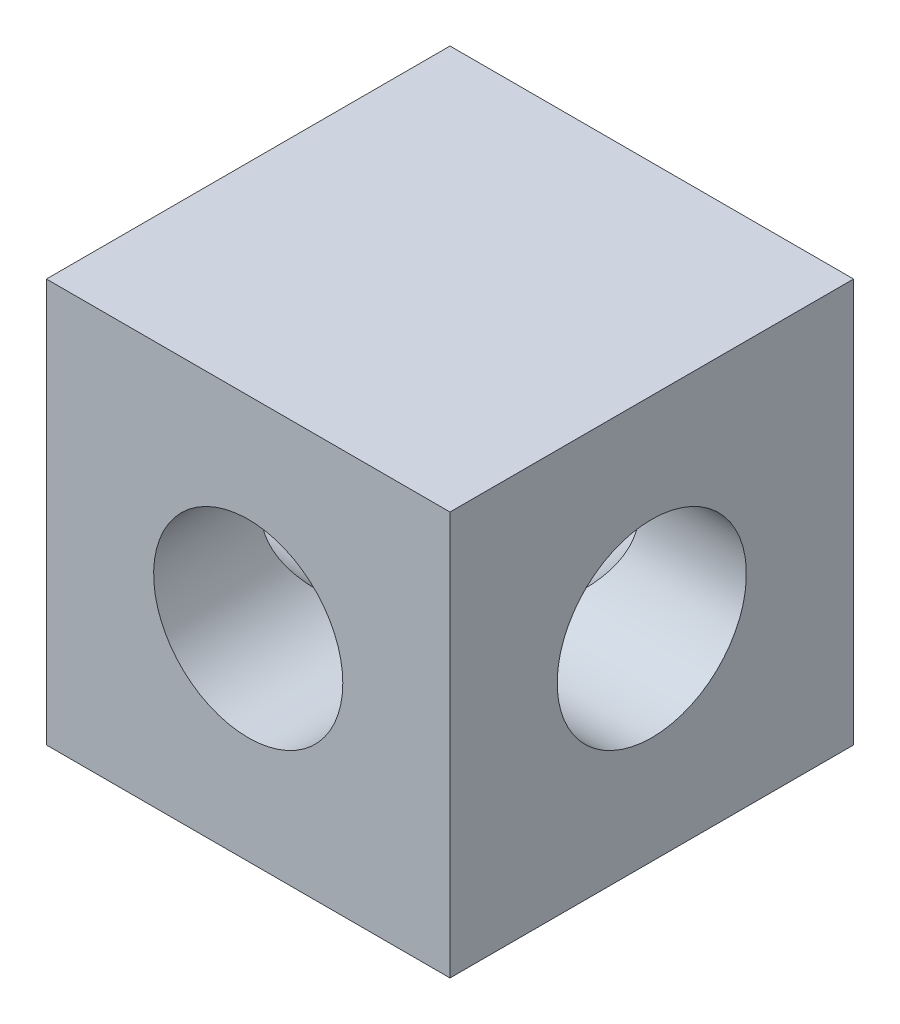
ISO-10303-21;
HEADER;
FILE_DESCRIPTION(('STEP AP214'),'2;1');
FILE_NAME('part.step','',(''),(''),'','','');
FILE_SCHEMA(('AUTOMOTIVE_DESIGN { 1 0 10303 214 1 1 1 1 }'));
ENDSEC;
DATA;
#1=APPLICATION_CONTEXT('core data for automotive mechanical design processes');
#2=APPLICATION_PROTOCOL_DEFINITION('international standard','automotive_design',2000,#1);
#3=PRODUCT_CONTEXT('',#1,'mechanical');
#4=PRODUCT('Part','Part','',(#3));
#5=PRODUCT_RELATED_PRODUCT_CATEGORY('part','',(#4));
#6=PRODUCT_DEFINITION_FORMATION('','',#4);
#7=PRODUCT_DEFINITION_CONTEXT('part definition',#1,'design');
#8=PRODUCT_DEFINITION('design','',#6,#7);
#9=PRODUCT_DEFINITION_SHAPE('','',#8);
#10=(LENGTH_UNIT() NAMED_UNIT(*) SI_UNIT(.MILLI.,.METRE.));
#11=(NAMED_UNIT(*) PLANE_ANGLE_UNIT() SI_UNIT($,.RADIAN.));
#12=(NAMED_UNIT(*) SI_UNIT($,.STERADIAN.) SOLID_ANGLE_UNIT());
#13=UNCERTAINTY_MEASURE_WITH_UNIT(LENGTH_MEASURE(1.E-05),#10,'distance_accuracy_value','');
#14=(GEOMETRIC_REPRESENTATION_CONTEXT(3) GLOBAL_UNCERTAINTY_ASSIGNED_CONTEXT((#13)) GLOBAL_UNIT_ASSIGNED_CONTEXT((#10,
#11,#12)) REPRESENTATION_CONTEXT('',''));
#15=CARTESIAN_POINT('',(0.,0.,0.));
#16=DIRECTION('',(0.,0.,1.));
#17=DIRECTION('',(1.,0.,0.));
#18=AXIS2_PLACEMENT_3D('',#15,#16,#17);
#19=CARTESIAN_POINT('',(-16.9782681564246,8.53525139664804,20.32));
#20=DIRECTION('',(0.,0.,-1.));
#21=DIRECTION('',(-1.,0.,0.));
#22=AXIS2_PLACEMENT_3D('',#19,#20,#21);
#23=CYLINDRICAL_SURFACE('',#22,4.7625);
#24=CARTESIAN_POINT('',(-16.9782681564246,8.53525139664804,10.16));
#25=DIRECTION('',(0.707106781186547,0.,-0.707106781186547));
#26=DIRECTION('',(-0.707106781186547,0.,-0.707106781186547));
#27=AXIS2_PLACEMENT_3D('',#24,#25,#26);
#28=ELLIPSE('',#27,6.73519209080187,4.7625);
#29=CARTESIAN_POINT('',(-16.9782681564246,3.77275139664804,10.16));
#30=VERTEX_POINT('',#29);
#31=CARTESIAN_POINT('',(-16.9782681564246,13.297751396648,10.16));
#32=VERTEX_POINT('',#31);
#33=EDGE_CURVE('E11',#30,#32,#28,.F.);
#34=ORIENTED_EDGE('',*,*,#33,.F.);
#35=CARTESIAN_POINT('',(-16.9782681564246,8.53525139664804,10.16));
#36=DIRECTION('',(-0.707106781186547,0.,-0.707106781186547));
#37=DIRECTION('',(0.707106781186547,0.,-0.707106781186547));
#38=AXIS2_PLACEMENT_3D('',#35,#36,#37);
#39=ELLIPSE('',#38,6.73519209080187,4.7625);
#40=EDGE_CURVE('E50',#32,#30,#39,.F.);
#41=ORIENTED_EDGE('',*,*,#40,.F.);
#42=EDGE_LOOP('',(#34,#41));
#43=FACE_BOUND('',#42,.T.);
#44=CARTESIAN_POINT('',(-16.9782681564246,8.53525139664804,20.32));
#45=DIRECTION('',(0.,0.,1.));
#46=DIRECTION('',(1.,0.,0.));
#47=AXIS2_PLACEMENT_3D('',#44,#45,#46);
#48=CIRCLE('',#47,4.7625);
#49=CARTESIAN_POINT('',(-12.2157681564246,8.53525139664804,20.32));
#50=VERTEX_POINT('',#49);
#51=EDGE_CURVE('E126',#50,#50,#48,.T.);
#52=ORIENTED_EDGE('',*,*,#51,.T.);
#53=EDGE_LOOP('',(#52));
#54=FACE_BOUND('',#53,.T.);
#55=ADVANCED_FACE('F36',(#43,#54),#23,.F.);
#56=CARTESIAN_POINT('',(-27.1382681564246,-1.62474860335196,20.32));
#57=DIRECTION('',(0.,0.,-1.));
#58=DIRECTION('',(-1.,0.,0.));
#59=AXIS2_PLACEMENT_3D('',#56,#57,#58);
#60=PLANE('',#59);
#61=DIRECTION('',(0.,1.,0.));
#62=VECTOR('',#61,1.);
#63=CARTESIAN_POINT('',(-27.1382681564246,-1.62474860335196,20.32));
#64=LINE('',#63,#62);
#65=CARTESIAN_POINT('',(-27.1382681564246,-1.62474860335196,20.32));
#66=VERTEX_POINT('',#65);
#67=CARTESIAN_POINT('',(-27.1382681564246,18.695251396648,20.32));
#68=VERTEX_POINT('',#67);
#69=EDGE_CURVE('E112',#66,#68,#64,.T.);
#70=ORIENTED_EDGE('',*,*,#69,.F.);
#71=DIRECTION('',(1.,0.,0.));
#72=VECTOR('',#71,1.);
#73=CARTESIAN_POINT('',(-27.1382681564246,-1.62474860335196,20.32));
#74=LINE('',#73,#72);
#75=CARTESIAN_POINT('',(-6.81826815642458,-1.62474860335196,20.32));
#76=VERTEX_POINT('',#75);
#77=EDGE_CURVE('E101',#66,#76,#74,.T.);
#78=ORIENTED_EDGE('',*,*,#77,.T.);
#79=DIRECTION('',(0.,-1.,0.));
#80=VECTOR('',#79,1.);
#81=CARTESIAN_POINT('',(-6.81826815642458,18.695251396648,20.32));
#82=LINE('',#81,#80);
#83=CARTESIAN_POINT('',(-6.81826815642458,18.695251396648,20.32));
#84=VERTEX_POINT('',#83);
#85=EDGE_CURVE('E107',#84,#76,#82,.T.);
#86=ORIENTED_EDGE('',*,*,#85,.F.);
#87=DIRECTION('',(-1.,0.,0.));
#88=VECTOR('',#87,1.);
#89=CARTESIAN_POINT('',(-6.81826815642458,18.695251396648,20.32));
#90=LINE('',#89,#88);
#91=EDGE_CURVE('E110',#84,#68,#90,.T.);
#92=ORIENTED_EDGE('',*,*,#91,.T.);
#93=EDGE_LOOP('',(#70,#78,#86,#92));
#94=FACE_BOUND('',#93,.T.);
#95=ORIENTED_EDGE('',*,*,#51,.F.);
#96=EDGE_LOOP('',(#95));
#97=FACE_BOUND('',#96,.T.);
#98=ADVANCED_FACE('F158',(#94,#97),#60,.F.);
#99=CARTESIAN_POINT('',(-27.1382681564246,-1.62474860335196,0.));
#100=DIRECTION('',(0.,0.,-1.));
#101=DIRECTION('',(-1.,0.,0.));
#102=AXIS2_PLACEMENT_3D('',#99,#100,#101);
#103=PLANE('',#102);
#104=DIRECTION('',(0.,1.,0.));
#105=VECTOR('',#104,1.);
#106=CARTESIAN_POINT('',(-27.1382681564246,-1.62474860335196,0.));
#107=LINE('',#106,#105);
#108=CARTESIAN_POINT('',(-27.1382681564246,-1.62474860335196,0.));
#109=VERTEX_POINT('',#108);
#110=CARTESIAN_POINT('',(-27.1382681564246,18.695251396648,0.));
#111=VERTEX_POINT('',#110);
#112=EDGE_CURVE('E123',#109,#111,#107,.T.);
#113=ORIENTED_EDGE('',*,*,#112,.T.);
#114=DIRECTION('',(-1.,0.,0.));
#115=VECTOR('',#114,1.);
#116=CARTESIAN_POINT('',(-6.81826815642458,18.695251396648,0.));
#117=LINE('',#116,#115);
#118=CARTESIAN_POINT('',(-6.81826815642458,18.695251396648,0.));
#119=VERTEX_POINT('',#118);
#120=EDGE_CURVE('E120',#119,#111,#117,.T.);
#121=ORIENTED_EDGE('',*,*,#120,.F.);
#122=DIRECTION('',(0.,-1.,0.));
#123=VECTOR('',#122,1.);
#124=CARTESIAN_POINT('',(-6.81826815642458,18.695251396648,0.));
#125=LINE('',#124,#123);
#126=CARTESIAN_POINT('',(-6.81826815642458,-1.62474860335196,0.));
#127=VERTEX_POINT('',#126);
#128=EDGE_CURVE('E117',#119,#127,#125,.T.);
#129=ORIENTED_EDGE('',*,*,#128,.T.);
#130=DIRECTION('',(1.,0.,0.));
#131=VECTOR('',#130,1.);
#132=CARTESIAN_POINT('',(-27.1382681564246,-1.62474860335196,0.));
#133=LINE('',#132,#131);
#134=EDGE_CURVE('E114',#109,#127,#133,.T.);
#135=ORIENTED_EDGE('',*,*,#134,.F.);
#136=EDGE_LOOP('',(#113,#121,#129,#135));
#137=FACE_BOUND('',#136,.T.);
#138=CARTESIAN_POINT('',(-16.9782681564246,8.53525139664804,0.));
#139=DIRECTION('',(0.,0.,1.));
#140=DIRECTION('',(1.,0.,0.));
#141=AXIS2_PLACEMENT_3D('',#138,#139,#140);
#142=CIRCLE('',#141,4.7625);
#143=CARTESIAN_POINT('',(-12.2157681564246,8.53525139664804,0.));
#144=VERTEX_POINT('',#143);
#145=EDGE_CURVE('E129',#144,#144,#142,.T.);
#146=ORIENTED_EDGE('',*,*,#145,.T.);
#147=EDGE_LOOP('',(#146));
#148=FACE_BOUND('',#147,.T.);
#149=ADVANCED_FACE('F151',(#137,#148),#103,.T.);
#150=CARTESIAN_POINT('',(-27.1382681564246,-1.62474860335196,20.32));
#151=DIRECTION('',(-1.,0.,0.));
#152=DIRECTION('',(0.,-1.,0.));
#153=AXIS2_PLACEMENT_3D('',#150,#151,#152);
#154=PLANE('',#153);
#155=CARTESIAN_POINT('',(-27.1382681564246,8.53525139664804,10.16));
#156=DIRECTION('',(1.,0.,0.));
#157=DIRECTION('',(0.,1.,0.));
#158=AXIS2_PLACEMENT_3D('',#155,#156,#157);
#159=CIRCLE('',#158,4.7625);
#160=CARTESIAN_POINT('',(-27.1382681564246,13.297751396648,10.16));
#161=VERTEX_POINT('',#160);
#162=EDGE_CURVE('E132',#161,#161,#159,.T.);
#163=ORIENTED_EDGE('',*,*,#162,.T.);
#164=EDGE_LOOP('',(#163));
#165=FACE_BOUND('',#164,.T.);
#166=ORIENTED_EDGE('',*,*,#112,.F.);
#167=DIRECTION('',(0.,0.,-1.));
#168=VECTOR('',#167,1.);
#169=CARTESIAN_POINT('',(-27.1382681564246,-1.62474860335196,20.32));
#170=LINE('',#169,#168);
#171=EDGE_CURVE('E58',#66,#109,#170,.T.);
#172=ORIENTED_EDGE('',*,*,#171,.F.);
#173=ORIENTED_EDGE('',*,*,#69,.T.);
#174=DIRECTION('',(0.,0.,-1.));
#175=VECTOR('',#174,1.);
#176=CARTESIAN_POINT('',(-27.1382681564246,18.695251396648,20.32));
#177=LINE('',#176,#175);
#178=EDGE_CURVE('E98',#68,#111,#177,.T.);
#179=ORIENTED_EDGE('',*,*,#178,.T.);
#180=EDGE_LOOP('',(#166,#172,#173,#179));
#181=FACE_BOUND('',#180,.T.);
#182=ADVANCED_FACE('F38',(#165,#181),#154,.T.);
#183=CARTESIAN_POINT('',(-27.1382681564246,-1.62474860335196,20.32));
#184=DIRECTION('',(0.,1.,0.));
#185=DIRECTION('',(0.,0.,1.));
#186=AXIS2_PLACEMENT_3D('',#183,#184,#185);
#187=PLANE('',#186);
#188=ORIENTED_EDGE('',*,*,#134,.T.);
#189=DIRECTION('',(0.,0.,-1.));
#190=VECTOR('',#189,1.);
#191=CARTESIAN_POINT('',(-6.81826815642458,-1.62474860335196,20.32));
#192=LINE('',#191,#190);
#193=EDGE_CURVE('E103',#76,#127,#192,.T.);
#194=ORIENTED_EDGE('',*,*,#193,.F.);
#195=ORIENTED_EDGE('',*,*,#77,.F.);
#196=ORIENTED_EDGE('',*,*,#171,.T.);
#197=EDGE_LOOP('',(#188,#194,#195,#196));
#198=FACE_BOUND('',#197,.T.);
#199=ADVANCED_FACE('F143',(#198),#187,.F.);
#200=CARTESIAN_POINT('',(-6.81826815642458,18.695251396648,20.32));
#201=DIRECTION('',(1.,0.,0.));
#202=DIRECTION('',(0.,1.,0.));
#203=AXIS2_PLACEMENT_3D('',#200,#201,#202);
#204=PLANE('',#203);
#205=CARTESIAN_POINT('',(-6.81826815642458,8.53525139664804,10.16));
#206=DIRECTION('',(1.,0.,0.));
#207=DIRECTION('',(0.,1.,0.));
#208=AXIS2_PLACEMENT_3D('',#205,#206,#207);
#209=CIRCLE('',#208,4.7625);
#210=CARTESIAN_POINT('',(-6.81826815642458,13.297751396648,10.16));
#211=VERTEX_POINT('',#210);
#212=EDGE_CURVE('E135',#211,#211,#209,.T.);
#213=ORIENTED_EDGE('',*,*,#212,.F.);
#214=EDGE_LOOP('',(#213));
#215=FACE_BOUND('',#214,.T.);
#216=ORIENTED_EDGE('',*,*,#128,.F.);
#217=DIRECTION('',(0.,0.,-1.));
#218=VECTOR('',#217,1.);
#219=CARTESIAN_POINT('',(-6.81826815642458,18.695251396648,20.32));
#220=LINE('',#219,#218);
#221=EDGE_CURVE('E100',#84,#119,#220,.T.);
#222=ORIENTED_EDGE('',*,*,#221,.F.);
#223=ORIENTED_EDGE('',*,*,#85,.T.);
#224=ORIENTED_EDGE('',*,*,#193,.T.);
#225=EDGE_LOOP('',(#216,#222,#223,#224));
#226=FACE_BOUND('',#225,.T.);
#227=ADVANCED_FACE('F139',(#215,#226),#204,.T.);
#228=CARTESIAN_POINT('',(-6.81826815642458,18.695251396648,20.32));
#229=DIRECTION('',(0.,-1.,0.));
#230=DIRECTION('',(1.,0.,0.));
#231=AXIS2_PLACEMENT_3D('',#228,#229,#230);
#232=PLANE('',#231);
#233=ORIENTED_EDGE('',*,*,#120,.T.);
#234=ORIENTED_EDGE('',*,*,#178,.F.);
#235=ORIENTED_EDGE('',*,*,#91,.F.);
#236=ORIENTED_EDGE('',*,*,#221,.T.);
#237=EDGE_LOOP('',(#233,#234,#235,#236));
#238=FACE_BOUND('',#237,.T.);
#239=ADVANCED_FACE('F142',(#238),#232,.F.);
#240=CARTESIAN_POINT('',(-16.9782681564246,8.53525139664804,10.16));
#241=DIRECTION('',(0.707106781186547,0.,-0.707106781186547));
#242=DIRECTION('',(-0.707106781186547,0.,-0.707106781186547));
#243=AXIS2_PLACEMENT_3D('',#240,#241,#242);
#244=ELLIPSE('',#243,6.73519209080187,4.7625);
#245=EDGE_CURVE('E44',#30,#32,#244,.T.);
#246=ORIENTED_EDGE('',*,*,#245,.F.);
#247=CARTESIAN_POINT('',(-16.9782681564246,8.53525139664804,10.16));
#248=DIRECTION('',(-0.707106781186547,0.,-0.707106781186547));
#249=DIRECTION('',(0.707106781186547,0.,-0.707106781186547));
#250=AXIS2_PLACEMENT_3D('',#247,#248,#249);
#251=ELLIPSE('',#250,6.73519209080187,4.7625);
#252=EDGE_CURVE('E84',#32,#30,#251,.T.);
#253=ORIENTED_EDGE('',*,*,#252,.F.);
#254=EDGE_LOOP('',(#246,#253));
#255=FACE_BOUND('',#254,.T.);
#256=ORIENTED_EDGE('',*,*,#145,.F.);
#257=EDGE_LOOP('',(#256));
#258=FACE_BOUND('',#257,.T.);
#259=ADVANCED_FACE('F95',(#255,#258),#23,.F.);
#260=CARTESIAN_POINT('',(-27.1382681564246,8.53525139664804,10.16));
#261=DIRECTION('',(1.,0.,0.));
#262=DIRECTION('',(0.,1.,0.));
#263=AXIS2_PLACEMENT_3D('',#260,#261,#262);
#264=CYLINDRICAL_SURFACE('',#263,4.7625);
#265=ORIENTED_EDGE('',*,*,#245,.T.);
#266=ORIENTED_EDGE('',*,*,#40,.T.);
#267=EDGE_LOOP('',(#265,#266));
#268=FACE_BOUND('',#267,.T.);
#269=ORIENTED_EDGE('',*,*,#162,.F.);
#270=EDGE_LOOP('',(#269));
#271=FACE_BOUND('',#270,.T.);
#272=ADVANCED_FACE('F91',(#268,#271),#264,.F.);
#273=ORIENTED_EDGE('',*,*,#33,.T.);
#274=ORIENTED_EDGE('',*,*,#252,.T.);
#275=EDGE_LOOP('',(#273,#274));
#276=FACE_BOUND('',#275,.T.);
#277=ORIENTED_EDGE('',*,*,#212,.T.);
#278=EDGE_LOOP('',(#277));
#279=FACE_BOUND('',#278,.T.);
#280=ADVANCED_FACE('F85',(#276,#279),#264,.F.);
#281=CLOSED_SHELL('',(#55,#98,#149,#182,#199,#227,#239,#259,#272,#280));
#282=MANIFOLD_SOLID_BREP('B2',#281);
#283=ADVANCED_BREP_SHAPE_REPRESENTATION('',(#18,#282),#14);
#284=SHAPE_DEFINITION_REPRESENTATION(#9,#283);
ENDSEC;
END-ISO-10303-21;
